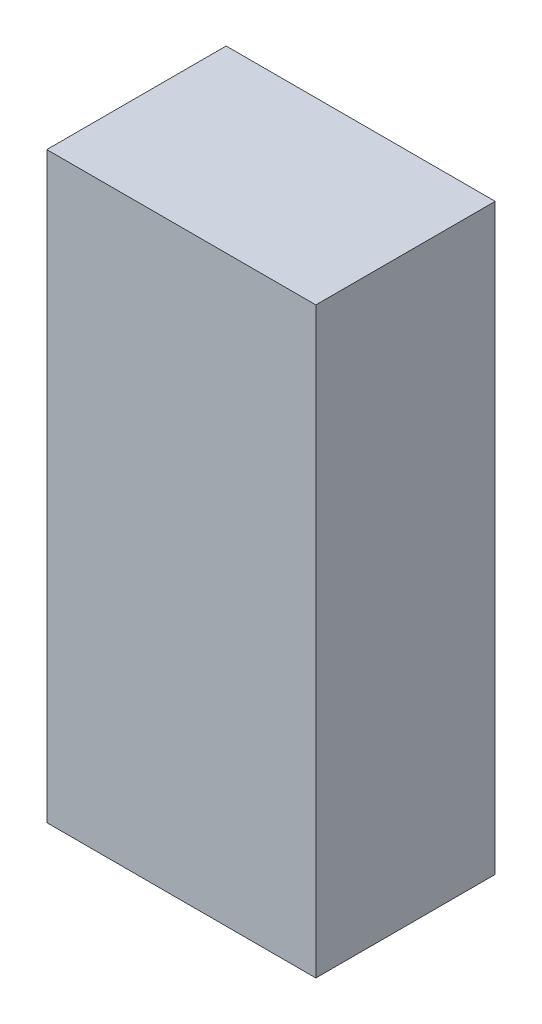
ISO-10303-21;
HEADER;
FILE_DESCRIPTION(('STEP AP214'),'2;1');
FILE_NAME('part.step','',(''),(''),'','','');
FILE_SCHEMA(('AUTOMOTIVE_DESIGN { 1 0 10303 214 1 1 1 1 }'));
ENDSEC;
DATA;
#1=APPLICATION_CONTEXT('core data for automotive mechanical design processes');
#2=APPLICATION_PROTOCOL_DEFINITION('international standard','automotive_design',2000,#1);
#3=PRODUCT_CONTEXT('',#1,'mechanical');
#4=PRODUCT('Part','Part','',(#3));
#5=PRODUCT_RELATED_PRODUCT_CATEGORY('part','',(#4));
#6=PRODUCT_DEFINITION_FORMATION('','',#4);
#7=PRODUCT_DEFINITION_CONTEXT('part definition',#1,'design');
#8=PRODUCT_DEFINITION('design','',#6,#7);
#9=PRODUCT_DEFINITION_SHAPE('','',#8);
#10=(LENGTH_UNIT() NAMED_UNIT(*) SI_UNIT(.MILLI.,.METRE.));
#11=(NAMED_UNIT(*) PLANE_ANGLE_UNIT() SI_UNIT($,.RADIAN.));
#12=(NAMED_UNIT(*) SI_UNIT($,.STERADIAN.) SOLID_ANGLE_UNIT());
#13=UNCERTAINTY_MEASURE_WITH_UNIT(LENGTH_MEASURE(1.E-05),#10,'distance_accuracy_value','');
#14=(GEOMETRIC_REPRESENTATION_CONTEXT(3) GLOBAL_UNCERTAINTY_ASSIGNED_CONTEXT((#13)) GLOBAL_UNIT_ASSIGNED_CONTEXT((#10,
#11,#12)) REPRESENTATION_CONTEXT('',''));
#15=CARTESIAN_POINT('',(0.,0.,0.));
#16=DIRECTION('',(0.,0.,1.));
#17=DIRECTION('',(1.,0.,0.));
#18=AXIS2_PLACEMENT_3D('',#15,#16,#17);
#19=CARTESIAN_POINT('',(-0.2999994,0.65000124,0.4));
#20=DIRECTION('',(0.,0.,1.));
#21=DIRECTION('',(1.,0.,0.));
#22=AXIS2_PLACEMENT_3D('',#19,#20,#21);
#23=PLANE('',#22);
#24=DIRECTION('',(0.,1.,0.));
#25=VECTOR('',#24,1.);
#26=CARTESIAN_POINT('',(0.30000194,0.65000124,0.4));
#27=LINE('',#26,#25);
#28=CARTESIAN_POINT('',(0.30000194,0.65000124,0.4));
#29=VERTEX_POINT('',#28);
#30=CARTESIAN_POINT('',(0.30000194,-0.6499987,0.4));
#31=VERTEX_POINT('',#30);
#32=EDGE_CURVE('E53',#29,#31,#27,.F.);
#33=ORIENTED_EDGE('',*,*,#32,.F.);
#34=DIRECTION('',(1.,0.,0.));
#35=VECTOR('',#34,1.);
#36=CARTESIAN_POINT('',(-0.2999994,0.65000124,0.4));
#37=LINE('',#36,#35);
#38=CARTESIAN_POINT('',(-0.2999994,0.65000124,0.4));
#39=VERTEX_POINT('',#38);
#40=EDGE_CURVE('E69',#39,#29,#37,.T.);
#41=ORIENTED_EDGE('',*,*,#40,.F.);
#42=DIRECTION('',(0.,1.,0.));
#43=VECTOR('',#42,1.);
#44=CARTESIAN_POINT('',(-0.2999994,-0.6499987,0.4));
#45=LINE('',#44,#43);
#46=CARTESIAN_POINT('',(-0.2999994,-0.6499987,0.4));
#47=VERTEX_POINT('',#46);
#48=EDGE_CURVE('E19',#47,#39,#45,.T.);
#49=ORIENTED_EDGE('',*,*,#48,.F.);
#50=DIRECTION('',(1.,0.,0.));
#51=VECTOR('',#50,1.);
#52=CARTESIAN_POINT('',(0.30000194,-0.6499987,0.4));
#53=LINE('',#52,#51);
#54=EDGE_CURVE('E58',#31,#47,#53,.F.);
#55=ORIENTED_EDGE('',*,*,#54,.F.);
#56=EDGE_LOOP('',(#33,#41,#49,#55));
#57=FACE_BOUND('',#56,.T.);
#58=ADVANCED_FACE('F16',(#57),#23,.T.);
#59=CARTESIAN_POINT('',(-0.2999994,-0.6499987,0.));
#60=DIRECTION('',(-1.,0.,0.));
#61=DIRECTION('',(0.,0.,1.));
#62=AXIS2_PLACEMENT_3D('',#59,#60,#61);
#63=PLANE('',#62);
#64=DIRECTION('',(0.,0.,1.));
#65=VECTOR('',#64,1.);
#66=CARTESIAN_POINT('',(-0.2999994,0.65000124,0.));
#67=LINE('',#66,#65);
#68=CARTESIAN_POINT('',(-0.2999994,0.65000124,0.));
#69=VERTEX_POINT('',#68);
#70=EDGE_CURVE('E88',#69,#39,#67,.T.);
#71=ORIENTED_EDGE('',*,*,#70,.F.);
#72=DIRECTION('',(0.,1.,0.));
#73=VECTOR('',#72,1.);
#74=CARTESIAN_POINT('',(-0.2999994,0.65000124,0.));
#75=LINE('',#74,#73);
#76=CARTESIAN_POINT('',(-0.2999994,-0.6499987,0.));
#77=VERTEX_POINT('',#76);
#78=EDGE_CURVE('E76',#69,#77,#75,.F.);
#79=ORIENTED_EDGE('',*,*,#78,.T.);
#80=DIRECTION('',(0.,0.,-1.));
#81=VECTOR('',#80,1.);
#82=CARTESIAN_POINT('',(-0.2999994,-0.6499987,0.));
#83=LINE('',#82,#81);
#84=EDGE_CURVE('E63',#47,#77,#83,.T.);
#85=ORIENTED_EDGE('',*,*,#84,.F.);
#86=ORIENTED_EDGE('',*,*,#48,.T.);
#87=EDGE_LOOP('',(#71,#79,#85,#86));
#88=FACE_BOUND('',#87,.T.);
#89=ADVANCED_FACE('F75',(#88),#63,.T.);
#90=CARTESIAN_POINT('',(0.30000194,-0.6499987,0.));
#91=DIRECTION('',(0.,-1.,0.));
#92=DIRECTION('',(0.,0.,-1.));
#93=AXIS2_PLACEMENT_3D('',#90,#91,#92);
#94=PLANE('',#93);
#95=ORIENTED_EDGE('',*,*,#84,.T.);
#96=DIRECTION('',(1.,0.,0.));
#97=VECTOR('',#96,1.);
#98=CARTESIAN_POINT('',(-0.2999994,-0.6499987,0.));
#99=LINE('',#98,#97);
#100=CARTESIAN_POINT('',(0.30000194,-0.6499987,0.));
#101=VERTEX_POINT('',#100);
#102=EDGE_CURVE('E96',#77,#101,#99,.T.);
#103=ORIENTED_EDGE('',*,*,#102,.T.);
#104=DIRECTION('',(0.,0.,-1.));
#105=VECTOR('',#104,1.);
#106=CARTESIAN_POINT('',(0.30000194,-0.6499987,0.));
#107=LINE('',#106,#105);
#108=EDGE_CURVE('E65',#31,#101,#107,.T.);
#109=ORIENTED_EDGE('',*,*,#108,.F.);
#110=ORIENTED_EDGE('',*,*,#54,.T.);
#111=EDGE_LOOP('',(#95,#103,#109,#110));
#112=FACE_BOUND('',#111,.T.);
#113=ADVANCED_FACE('F60',(#112),#94,.T.);
#114=CARTESIAN_POINT('',(0.30000194,0.65000124,0.));
#115=DIRECTION('',(1.,0.,0.));
#116=DIRECTION('',(0.,0.,-1.));
#117=AXIS2_PLACEMENT_3D('',#114,#115,#116);
#118=PLANE('',#117);
#119=ORIENTED_EDGE('',*,*,#108,.T.);
#120=DIRECTION('',(0.,1.,0.));
#121=VECTOR('',#120,1.);
#122=CARTESIAN_POINT('',(0.30000194,0.65000124,0.));
#123=LINE('',#122,#121);
#124=CARTESIAN_POINT('',(0.30000194,0.65000124,0.));
#125=VERTEX_POINT('',#124);
#126=EDGE_CURVE('E26',#101,#125,#123,.T.);
#127=ORIENTED_EDGE('',*,*,#126,.T.);
#128=DIRECTION('',(0.,0.,1.));
#129=VECTOR('',#128,1.);
#130=CARTESIAN_POINT('',(0.30000194,0.65000124,0.));
#131=LINE('',#130,#129);
#132=EDGE_CURVE('E34',#29,#125,#131,.F.);
#133=ORIENTED_EDGE('',*,*,#132,.F.);
#134=ORIENTED_EDGE('',*,*,#32,.T.);
#135=EDGE_LOOP('',(#119,#127,#133,#134));
#136=FACE_BOUND('',#135,.T.);
#137=ADVANCED_FACE('F102',(#136),#118,.T.);
#138=CARTESIAN_POINT('',(-0.2999994,0.65000124,0.));
#139=DIRECTION('',(0.,1.,0.));
#140=DIRECTION('',(0.,0.,1.));
#141=AXIS2_PLACEMENT_3D('',#138,#139,#140);
#142=PLANE('',#141);
#143=ORIENTED_EDGE('',*,*,#132,.T.);
#144=DIRECTION('',(1.,0.,0.));
#145=VECTOR('',#144,1.);
#146=CARTESIAN_POINT('',(-0.2999994,0.65000124,0.));
#147=LINE('',#146,#145);
#148=EDGE_CURVE('E11',#125,#69,#147,.F.);
#149=ORIENTED_EDGE('',*,*,#148,.T.);
#150=ORIENTED_EDGE('',*,*,#70,.T.);
#151=ORIENTED_EDGE('',*,*,#40,.T.);
#152=EDGE_LOOP('',(#143,#149,#150,#151));
#153=FACE_BOUND('',#152,.T.);
#154=ADVANCED_FACE('F105',(#153),#142,.T.);
#155=CARTESIAN_POINT('',(-0.2999994,0.65000124,0.));
#156=DIRECTION('',(0.,0.,1.));
#157=DIRECTION('',(1.,0.,0.));
#158=AXIS2_PLACEMENT_3D('',#155,#156,#157);
#159=PLANE('',#158);
#160=ORIENTED_EDGE('',*,*,#126,.F.);
#161=ORIENTED_EDGE('',*,*,#102,.F.);
#162=ORIENTED_EDGE('',*,*,#78,.F.);
#163=ORIENTED_EDGE('',*,*,#148,.F.);
#164=EDGE_LOOP('',(#160,#161,#162,#163));
#165=FACE_BOUND('',#164,.T.);
#166=ADVANCED_FACE('F104',(#165),#159,.F.);
#167=CLOSED_SHELL('',(#58,#89,#113,#137,#154,#166));
#168=MANIFOLD_SOLID_BREP('B1',#167);
#169=ADVANCED_BREP_SHAPE_REPRESENTATION('',(#18,#168),#14);
#170=SHAPE_DEFINITION_REPRESENTATION(#9,#169);
ENDSEC;
END-ISO-10303-21;
